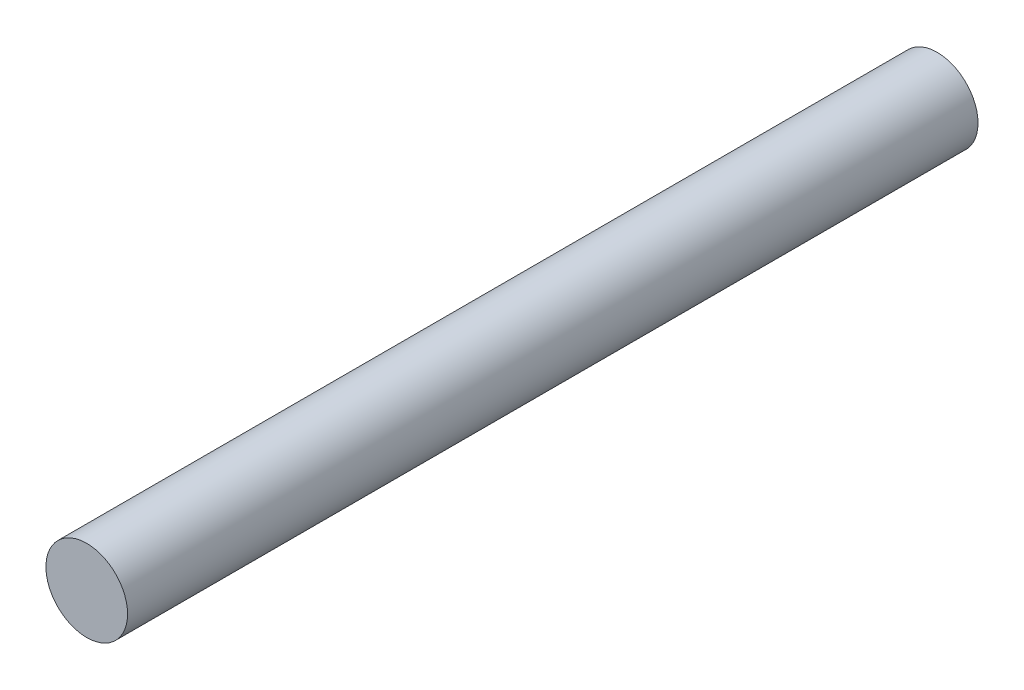
ISO-10303-21;
HEADER;
FILE_DESCRIPTION(('STEP AP214'),'2;1');
FILE_NAME('part.step','',(''),(''),'','','');
FILE_SCHEMA(('AUTOMOTIVE_DESIGN { 1 0 10303 214 1 1 1 1 }'));
ENDSEC;
DATA;
#1=APPLICATION_CONTEXT('core data for automotive mechanical design processes');
#2=APPLICATION_PROTOCOL_DEFINITION('international standard','automotive_design',2000,#1);
#3=PRODUCT_CONTEXT('',#1,'mechanical');
#4=PRODUCT('Part','Part','',(#3));
#5=PRODUCT_RELATED_PRODUCT_CATEGORY('part','',(#4));
#6=PRODUCT_DEFINITION_FORMATION('','',#4);
#7=PRODUCT_DEFINITION_CONTEXT('part definition',#1,'design');
#8=PRODUCT_DEFINITION('design','',#6,#7);
#9=PRODUCT_DEFINITION_SHAPE('','',#8);
#10=(LENGTH_UNIT() NAMED_UNIT(*) SI_UNIT(.MILLI.,.METRE.));
#11=(NAMED_UNIT(*) PLANE_ANGLE_UNIT() SI_UNIT($,.RADIAN.));
#12=(NAMED_UNIT(*) SI_UNIT($,.STERADIAN.) SOLID_ANGLE_UNIT());
#13=UNCERTAINTY_MEASURE_WITH_UNIT(LENGTH_MEASURE(1.E-05),#10,'distance_accuracy_value','');
#14=(GEOMETRIC_REPRESENTATION_CONTEXT(3) GLOBAL_UNCERTAINTY_ASSIGNED_CONTEXT((#13)) GLOBAL_UNIT_ASSIGNED_CONTEXT((#10,
#11,#12)) REPRESENTATION_CONTEXT('',''));
#15=CARTESIAN_POINT('',(0.,0.,0.));
#16=DIRECTION('',(0.,0.,1.));
#17=DIRECTION('',(1.,0.,0.));
#18=AXIS2_PLACEMENT_3D('',#15,#16,#17);
#19=CARTESIAN_POINT('',(0.,0.,500.));
#20=DIRECTION('',(0.,0.,-1.));
#21=DIRECTION('',(-1.,0.,0.));
#22=AXIS2_PLACEMENT_3D('',#19,#20,#21);
#23=CYLINDRICAL_SURFACE('',#22,24.);
#24=CARTESIAN_POINT('',(0.,0.,500.));
#25=DIRECTION('',(0.,0.,1.));
#26=DIRECTION('',(1.,0.,0.));
#27=AXIS2_PLACEMENT_3D('',#24,#25,#26);
#28=CIRCLE('',#27,24.);
#29=CARTESIAN_POINT('',(24.,0.,500.));
#30=VERTEX_POINT('',#29);
#31=EDGE_CURVE('E10',#30,#30,#28,.T.);
#32=ORIENTED_EDGE('',*,*,#31,.F.);
#33=EDGE_LOOP('',(#32));
#34=FACE_BOUND('',#33,.T.);
#35=CARTESIAN_POINT('',(0.,0.,0.));
#36=DIRECTION('',(0.,0.,1.));
#37=DIRECTION('',(1.,0.,0.));
#38=AXIS2_PLACEMENT_3D('',#35,#36,#37);
#39=CIRCLE('',#38,24.);
#40=CARTESIAN_POINT('',(24.,0.,0.));
#41=VERTEX_POINT('',#40);
#42=EDGE_CURVE('E34',#41,#41,#39,.T.);
#43=ORIENTED_EDGE('',*,*,#42,.T.);
#44=EDGE_LOOP('',(#43));
#45=FACE_BOUND('',#44,.T.);
#46=ADVANCED_FACE('F31',(#34,#45),#23,.T.);
#47=CARTESIAN_POINT('',(0.,0.,500.));
#48=DIRECTION('',(0.,0.,1.));
#49=DIRECTION('',(1.,0.,0.));
#50=AXIS2_PLACEMENT_3D('',#47,#48,#49);
#51=PLANE('',#50);
#52=ORIENTED_EDGE('',*,*,#31,.T.);
#53=EDGE_LOOP('',(#52));
#54=FACE_BOUND('',#53,.T.);
#55=ADVANCED_FACE('F46',(#54),#51,.T.);
#56=CARTESIAN_POINT('',(0.,0.,0.));
#57=DIRECTION('',(0.,0.,1.));
#58=DIRECTION('',(1.,0.,0.));
#59=AXIS2_PLACEMENT_3D('',#56,#57,#58);
#60=PLANE('',#59);
#61=ORIENTED_EDGE('',*,*,#42,.F.);
#62=EDGE_LOOP('',(#61));
#63=FACE_BOUND('',#62,.T.);
#64=ADVANCED_FACE('F44',(#63),#60,.F.);
#65=CLOSED_SHELL('',(#46,#55,#64));
#66=MANIFOLD_SOLID_BREP('B2',#65);
#67=ADVANCED_BREP_SHAPE_REPRESENTATION('',(#18,#66),#14);
#68=SHAPE_DEFINITION_REPRESENTATION(#9,#67);
ENDSEC;
END-ISO-10303-21;
